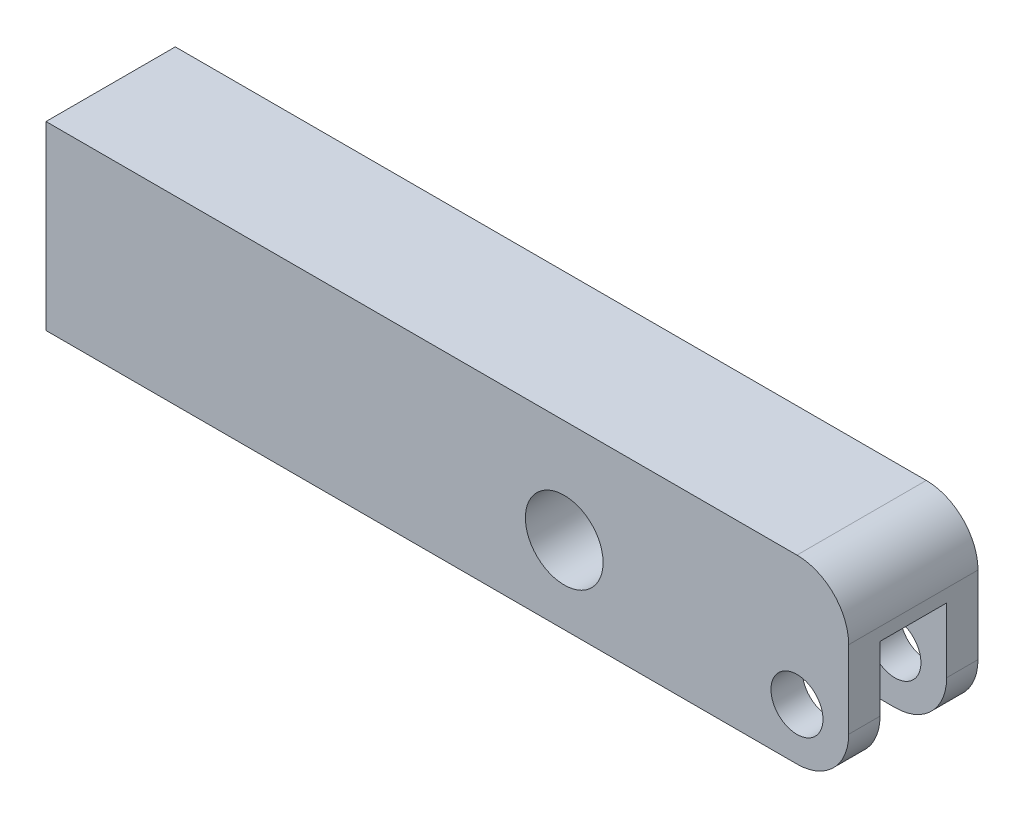
ISO-10303-21;
HEADER;
FILE_DESCRIPTION(('STEP AP214'),'2;1');
FILE_NAME('part.step','',(''),(''),'','','');
FILE_SCHEMA(('AUTOMOTIVE_DESIGN { 1 0 10303 214 1 1 1 1 }'));
ENDSEC;
DATA;
#1=APPLICATION_CONTEXT('core data for automotive mechanical design processes');
#2=APPLICATION_PROTOCOL_DEFINITION('international standard','automotive_design',2000,#1);
#3=PRODUCT_CONTEXT('',#1,'mechanical');
#4=PRODUCT('Part','Part','',(#3));
#5=PRODUCT_RELATED_PRODUCT_CATEGORY('part','',(#4));
#6=PRODUCT_DEFINITION_FORMATION('','',#4);
#7=PRODUCT_DEFINITION_CONTEXT('part definition',#1,'design');
#8=PRODUCT_DEFINITION('design','',#6,#7);
#9=PRODUCT_DEFINITION_SHAPE('','',#8);
#10=(LENGTH_UNIT() NAMED_UNIT(*) SI_UNIT(.MILLI.,.METRE.));
#11=(NAMED_UNIT(*) PLANE_ANGLE_UNIT() SI_UNIT($,.RADIAN.));
#12=(NAMED_UNIT(*) SI_UNIT($,.STERADIAN.) SOLID_ANGLE_UNIT());
#13=UNCERTAINTY_MEASURE_WITH_UNIT(LENGTH_MEASURE(1.E-05),#10,'distance_accuracy_value','');
#14=(GEOMETRIC_REPRESENTATION_CONTEXT(3) GLOBAL_UNCERTAINTY_ASSIGNED_CONTEXT((#13)) GLOBAL_UNIT_ASSIGNED_CONTEXT((#10,
#11,#12)) REPRESENTATION_CONTEXT('',''));
#15=CARTESIAN_POINT('',(0.,0.,0.));
#16=DIRECTION('',(0.,0.,1.));
#17=DIRECTION('',(1.,0.,0.));
#18=AXIS2_PLACEMENT_3D('',#15,#16,#17);
#19=CARTESIAN_POINT('',(0.,0.,7.9375));
#20=DIRECTION('',(0.,0.,-1.));
#21=DIRECTION('',(-1.,0.,0.));
#22=AXIS2_PLACEMENT_3D('',#19,#20,#21);
#23=CYLINDRICAL_SURFACE('',#22,3.19405);
#24=CARTESIAN_POINT('',(0.,0.,4.0894));
#25=DIRECTION('',(0.,0.,1.));
#26=DIRECTION('',(1.,0.,0.));
#27=AXIS2_PLACEMENT_3D('',#24,#25,#26);
#28=CIRCLE('',#27,3.19405);
#29=CARTESIAN_POINT('',(3.19405,0.,4.0894));
#30=VERTEX_POINT('',#29);
#31=EDGE_CURVE('E163',#30,#30,#28,.T.);
#32=ORIENTED_EDGE('',*,*,#31,.F.);
#33=EDGE_LOOP('',(#32));
#34=FACE_BOUND('',#33,.T.);
#35=CARTESIAN_POINT('',(0.,0.,7.9375));
#36=DIRECTION('',(0.,0.,1.));
#37=DIRECTION('',(1.,0.,0.));
#38=AXIS2_PLACEMENT_3D('',#35,#36,#37);
#39=CIRCLE('',#38,3.19405);
#40=CARTESIAN_POINT('',(3.19405,0.,7.9375));
#41=VERTEX_POINT('',#40);
#42=EDGE_CURVE('E164',#41,#41,#39,.T.);
#43=ORIENTED_EDGE('',*,*,#42,.T.);
#44=EDGE_LOOP('',(#43));
#45=FACE_BOUND('',#44,.T.);
#46=ADVANCED_FACE('F35',(#34,#45),#23,.F.);
#47=CARTESIAN_POINT('',(-92.202,-6.35,7.9375));
#48=DIRECTION('',(0.,0.,1.));
#49=DIRECTION('',(1.,0.,0.));
#50=AXIS2_PLACEMENT_3D('',#47,#48,#49);
#51=PLANE('',#50);
#52=ORIENTED_EDGE('',*,*,#42,.F.);
#53=EDGE_LOOP('',(#52));
#54=FACE_BOUND('',#53,.T.);
#55=DIRECTION('',(0.,1.,0.));
#56=VECTOR('',#55,1.);
#57=CARTESIAN_POINT('',(6.35,15.875,7.9375));
#58=LINE('',#57,#56);
#59=CARTESIAN_POINT('',(6.35,0.,7.9375));
#60=VERTEX_POINT('',#59);
#61=CARTESIAN_POINT('',(6.35,9.525,7.9375));
#62=VERTEX_POINT('',#61);
#63=EDGE_CURVE('E177',#60,#62,#58,.T.);
#64=ORIENTED_EDGE('',*,*,#63,.T.);
#65=CARTESIAN_POINT('',(0.,9.525,7.9375));
#66=DIRECTION('',(0.,0.,1.));
#67=DIRECTION('',(1.,0.,0.));
#68=AXIS2_PLACEMENT_3D('',#65,#66,#67);
#69=CIRCLE('',#68,6.35);
#70=CARTESIAN_POINT('',(0.,15.875,7.9375));
#71=VERTEX_POINT('',#70);
#72=EDGE_CURVE('E217',#62,#71,#69,.T.);
#73=ORIENTED_EDGE('',*,*,#72,.T.);
#74=DIRECTION('',(-1.,0.,0.));
#75=VECTOR('',#74,1.);
#76=CARTESIAN_POINT('',(-92.202,15.875,7.9375));
#77=LINE('',#76,#75);
#78=CARTESIAN_POINT('',(-92.202,15.875,7.9375));
#79=VERTEX_POINT('',#78);
#80=EDGE_CURVE('E180',#71,#79,#77,.T.);
#81=ORIENTED_EDGE('',*,*,#80,.T.);
#82=DIRECTION('',(0.,-1.,0.));
#83=VECTOR('',#82,1.);
#84=CARTESIAN_POINT('',(-92.202,15.875,7.9375));
#85=LINE('',#84,#83);
#86=CARTESIAN_POINT('',(-92.202,-6.35,7.9375));
#87=VERTEX_POINT('',#86);
#88=EDGE_CURVE('E170',#79,#87,#85,.T.);
#89=ORIENTED_EDGE('',*,*,#88,.T.);
#90=DIRECTION('',(1.,0.,0.));
#91=VECTOR('',#90,1.);
#92=CARTESIAN_POINT('',(-92.202,-6.35,7.9375));
#93=LINE('',#92,#91);
#94=CARTESIAN_POINT('',(0.,-6.35,7.9375));
#95=VERTEX_POINT('',#94);
#96=EDGE_CURVE('E173',#87,#95,#93,.T.);
#97=ORIENTED_EDGE('',*,*,#96,.T.);
#98=CARTESIAN_POINT('',(0.,0.,7.9375));
#99=DIRECTION('',(0.,0.,1.));
#100=DIRECTION('',(1.,0.,0.));
#101=AXIS2_PLACEMENT_3D('',#98,#99,#100);
#102=CIRCLE('',#101,6.35);
#103=EDGE_CURVE('E215',#95,#60,#102,.T.);
#104=ORIENTED_EDGE('',*,*,#103,.T.);
#105=EDGE_LOOP('',(#64,#73,#81,#89,#97,#104));
#106=FACE_BOUND('',#105,.T.);
#107=CARTESIAN_POINT('',(-28.575,3.175,7.9375));
#108=DIRECTION('',(0.,0.,1.));
#109=DIRECTION('',(1.,0.,0.));
#110=AXIS2_PLACEMENT_3D('',#107,#108,#109);
#111=CIRCLE('',#110,4.76885);
#112=CARTESIAN_POINT('',(-23.80615,3.175,7.9375));
#113=VERTEX_POINT('',#112);
#114=EDGE_CURVE('E156',#113,#113,#111,.T.);
#115=ORIENTED_EDGE('',*,*,#114,.F.);
#116=EDGE_LOOP('',(#115));
#117=FACE_BOUND('',#116,.T.);
#118=ADVANCED_FACE('F251',(#54,#106,#117),#51,.T.);
#119=CARTESIAN_POINT('',(-92.202,-6.35,-7.9375));
#120=DIRECTION('',(0.,0.,1.));
#121=DIRECTION('',(1.,0.,0.));
#122=AXIS2_PLACEMENT_3D('',#119,#120,#121);
#123=PLANE('',#122);
#124=CARTESIAN_POINT('',(0.,0.,-7.9375));
#125=DIRECTION('',(0.,0.,1.));
#126=DIRECTION('',(1.,0.,0.));
#127=AXIS2_PLACEMENT_3D('',#124,#125,#126);
#128=CIRCLE('',#127,3.19405);
#129=CARTESIAN_POINT('',(3.19405,0.,-7.9375));
#130=VERTEX_POINT('',#129);
#131=EDGE_CURVE('E159',#130,#130,#128,.T.);
#132=ORIENTED_EDGE('',*,*,#131,.T.);
#133=EDGE_LOOP('',(#132));
#134=FACE_BOUND('',#133,.T.);
#135=DIRECTION('',(-1.,0.,0.));
#136=VECTOR('',#135,1.);
#137=CARTESIAN_POINT('',(-92.202,15.875,-7.9375));
#138=LINE('',#137,#136);
#139=CARTESIAN_POINT('',(0.,15.875,-7.9375));
#140=VERTEX_POINT('',#139);
#141=CARTESIAN_POINT('',(-92.202,15.875,-7.9375));
#142=VERTEX_POINT('',#141);
#143=EDGE_CURVE('E174',#140,#142,#138,.T.);
#144=ORIENTED_EDGE('',*,*,#143,.F.);
#145=CARTESIAN_POINT('',(0.,9.525,-7.9375));
#146=DIRECTION('',(0.,0.,1.));
#147=DIRECTION('',(1.,0.,0.));
#148=AXIS2_PLACEMENT_3D('',#145,#146,#147);
#149=CIRCLE('',#148,6.35);
#150=CARTESIAN_POINT('',(6.35,9.525,-7.9375));
#151=VERTEX_POINT('',#150);
#152=EDGE_CURVE('E205',#140,#151,#149,.F.);
#153=ORIENTED_EDGE('',*,*,#152,.T.);
#154=DIRECTION('',(0.,1.,0.));
#155=VECTOR('',#154,1.);
#156=CARTESIAN_POINT('',(6.35,15.875,-7.9375));
#157=LINE('',#156,#155);
#158=CARTESIAN_POINT('',(6.35,0.,-7.9375));
#159=VERTEX_POINT('',#158);
#160=EDGE_CURVE('E187',#159,#151,#157,.T.);
#161=ORIENTED_EDGE('',*,*,#160,.F.);
#162=CARTESIAN_POINT('',(0.,0.,-7.9375));
#163=DIRECTION('',(0.,0.,1.));
#164=DIRECTION('',(1.,0.,0.));
#165=AXIS2_PLACEMENT_3D('',#162,#163,#164);
#166=CIRCLE('',#165,6.35);
#167=CARTESIAN_POINT('',(0.,-6.35,-7.9375));
#168=VERTEX_POINT('',#167);
#169=EDGE_CURVE('E203',#159,#168,#166,.F.);
#170=ORIENTED_EDGE('',*,*,#169,.T.);
#171=DIRECTION('',(1.,0.,0.));
#172=VECTOR('',#171,1.);
#173=CARTESIAN_POINT('',(-92.202,-6.35,-7.9375));
#174=LINE('',#173,#172);
#175=CARTESIAN_POINT('',(-92.202,-6.35,-7.9375));
#176=VERTEX_POINT('',#175);
#177=EDGE_CURVE('E185',#176,#168,#174,.T.);
#178=ORIENTED_EDGE('',*,*,#177,.F.);
#179=DIRECTION('',(0.,-1.,0.));
#180=VECTOR('',#179,1.);
#181=CARTESIAN_POINT('',(-92.202,15.875,-7.9375));
#182=LINE('',#181,#180);
#183=EDGE_CURVE('E167',#142,#176,#182,.T.);
#184=ORIENTED_EDGE('',*,*,#183,.F.);
#185=EDGE_LOOP('',(#144,#153,#161,#170,#178,#184));
#186=FACE_BOUND('',#185,.T.);
#187=CARTESIAN_POINT('',(-28.575,3.175,-7.9375));
#188=DIRECTION('',(0.,0.,1.));
#189=DIRECTION('',(1.,0.,0.));
#190=AXIS2_PLACEMENT_3D('',#187,#188,#189);
#191=CIRCLE('',#190,4.76885);
#192=CARTESIAN_POINT('',(-23.80615,3.175,-7.9375));
#193=VERTEX_POINT('',#192);
#194=EDGE_CURVE('E160',#193,#193,#191,.T.);
#195=ORIENTED_EDGE('',*,*,#194,.T.);
#196=EDGE_LOOP('',(#195));
#197=FACE_BOUND('',#196,.T.);
#198=ADVANCED_FACE('F231',(#134,#186,#197),#123,.F.);
#199=CARTESIAN_POINT('',(-92.202,15.875,7.9375));
#200=DIRECTION('',(1.,0.,0.));
#201=DIRECTION('',(0.,0.,-1.));
#202=AXIS2_PLACEMENT_3D('',#199,#200,#201);
#203=PLANE('',#202);
#204=ORIENTED_EDGE('',*,*,#183,.T.);
#205=DIRECTION('',(0.,0.,-1.));
#206=VECTOR('',#205,1.);
#207=CARTESIAN_POINT('',(-92.202,-6.35,7.9375));
#208=LINE('',#207,#206);
#209=EDGE_CURVE('E193',#87,#176,#208,.T.);
#210=ORIENTED_EDGE('',*,*,#209,.F.);
#211=ORIENTED_EDGE('',*,*,#88,.F.);
#212=DIRECTION('',(0.,0.,-1.));
#213=VECTOR('',#212,1.);
#214=CARTESIAN_POINT('',(-92.202,15.875,7.9375));
#215=LINE('',#214,#213);
#216=EDGE_CURVE('E182',#79,#142,#215,.T.);
#217=ORIENTED_EDGE('',*,*,#216,.T.);
#218=EDGE_LOOP('',(#204,#210,#211,#217));
#219=FACE_BOUND('',#218,.T.);
#220=ADVANCED_FACE('F238',(#219),#203,.F.);
#221=CARTESIAN_POINT('',(-92.202,-6.35,7.9375));
#222=DIRECTION('',(0.,1.,0.));
#223=DIRECTION('',(0.,0.,1.));
#224=AXIS2_PLACEMENT_3D('',#221,#222,#223);
#225=PLANE('',#224);
#226=ORIENTED_EDGE('',*,*,#177,.T.);
#227=DIRECTION('',(0.,0.,-1.));
#228=VECTOR('',#227,1.);
#229=CARTESIAN_POINT('',(0.,-6.35,7.9375));
#230=LINE('',#229,#228);
#231=CARTESIAN_POINT('',(0.,-6.35,-4.0894));
#232=VERTEX_POINT('',#231);
#233=EDGE_CURVE('E50',#168,#232,#230,.F.);
#234=ORIENTED_EDGE('',*,*,#233,.T.);
#235=DIRECTION('',(1.,0.,0.));
#236=VECTOR('',#235,1.);
#237=CARTESIAN_POINT('',(-7.9248,-6.35,-4.0894));
#238=LINE('',#237,#236);
#239=CARTESIAN_POINT('',(-7.9248,-6.35,-4.0894));
#240=VERTEX_POINT('',#239);
#241=EDGE_CURVE('E143',#240,#232,#238,.T.);
#242=ORIENTED_EDGE('',*,*,#241,.F.);
#243=CARTESIAN_POINT('',(-7.9248,-6.35,0.));
#244=DIRECTION('',(0.,-1.,0.));
#245=DIRECTION('',(0.,0.,-1.));
#246=AXIS2_PLACEMENT_3D('',#243,#244,#245);
#247=CIRCLE('',#246,4.0894);
#248=CARTESIAN_POINT('',(-7.9248,-6.35,4.0894));
#249=VERTEX_POINT('',#248);
#250=EDGE_CURVE('E126',#249,#240,#247,.T.);
#251=ORIENTED_EDGE('',*,*,#250,.F.);
#252=DIRECTION('',(-1.,0.,0.));
#253=VECTOR('',#252,1.);
#254=CARTESIAN_POINT('',(-7.9248,-6.35,4.0894));
#255=LINE('',#254,#253);
#256=CARTESIAN_POINT('',(0.,-6.35,4.0894));
#257=VERTEX_POINT('',#256);
#258=EDGE_CURVE('E141',#257,#249,#255,.T.);
#259=ORIENTED_EDGE('',*,*,#258,.F.);
#260=DIRECTION('',(0.,0.,-1.));
#261=VECTOR('',#260,1.);
#262=CARTESIAN_POINT('',(0.,-6.35,7.9375));
#263=LINE('',#262,#261);
#264=EDGE_CURVE('E219',#257,#95,#263,.F.);
#265=ORIENTED_EDGE('',*,*,#264,.T.);
#266=ORIENTED_EDGE('',*,*,#96,.F.);
#267=ORIENTED_EDGE('',*,*,#209,.T.);
#268=EDGE_LOOP('',(#226,#234,#242,#251,#259,#265,#266,#267));
#269=FACE_BOUND('',#268,.T.);
#270=ADVANCED_FACE('F234',(#269),#225,.F.);
#271=CARTESIAN_POINT('',(6.35,15.875,7.9375));
#272=DIRECTION('',(-1.,0.,0.));
#273=DIRECTION('',(0.,-1.,0.));
#274=AXIS2_PLACEMENT_3D('',#271,#272,#273);
#275=PLANE('',#274);
#276=ORIENTED_EDGE('',*,*,#160,.T.);
#277=DIRECTION('',(0.,0.,-1.));
#278=VECTOR('',#277,1.);
#279=CARTESIAN_POINT('',(6.35,9.525,7.9375));
#280=LINE('',#279,#278);
#281=EDGE_CURVE('E213',#151,#62,#280,.F.);
#282=ORIENTED_EDGE('',*,*,#281,.T.);
#283=ORIENTED_EDGE('',*,*,#63,.F.);
#284=DIRECTION('',(0.,0.,-1.));
#285=VECTOR('',#284,1.);
#286=CARTESIAN_POINT('',(6.35,0.,7.9375));
#287=LINE('',#286,#285);
#288=CARTESIAN_POINT('',(6.34999999999999,0.,4.0894));
#289=VERTEX_POINT('',#288);
#290=EDGE_CURVE('E207',#60,#289,#287,.T.);
#291=ORIENTED_EDGE('',*,*,#290,.T.);
#292=DIRECTION('',(0.,-1.,0.));
#293=VECTOR('',#292,1.);
#294=CARTESIAN_POINT('',(6.34999999999999,7.9502,4.0894));
#295=LINE('',#294,#293);
#296=CARTESIAN_POINT('',(6.34999999999999,7.9502,4.0894));
#297=VERTEX_POINT('',#296);
#298=EDGE_CURVE('E153',#297,#289,#295,.T.);
#299=ORIENTED_EDGE('',*,*,#298,.F.);
#300=DIRECTION('',(0.,0.,1.));
#301=VECTOR('',#300,1.);
#302=CARTESIAN_POINT('',(6.34999999999999,7.9502,4.0894));
#303=LINE('',#302,#301);
#304=CARTESIAN_POINT('',(6.35,7.9502,-4.0894));
#305=VERTEX_POINT('',#304);
#306=EDGE_CURVE('E137',#305,#297,#303,.T.);
#307=ORIENTED_EDGE('',*,*,#306,.F.);
#308=DIRECTION('',(0.,-1.,0.));
#309=VECTOR('',#308,1.);
#310=CARTESIAN_POINT('',(6.35,7.9502,-4.0894));
#311=LINE('',#310,#309);
#312=CARTESIAN_POINT('',(6.35,0.,-4.0894));
#313=VERTEX_POINT('',#312);
#314=EDGE_CURVE('E128',#305,#313,#311,.T.);
#315=ORIENTED_EDGE('',*,*,#314,.T.);
#316=DIRECTION('',(0.,0.,-1.));
#317=VECTOR('',#316,1.);
#318=CARTESIAN_POINT('',(6.35,0.,7.9375));
#319=LINE('',#318,#317);
#320=EDGE_CURVE('E210',#313,#159,#319,.T.);
#321=ORIENTED_EDGE('',*,*,#320,.T.);
#322=EDGE_LOOP('',(#276,#282,#283,#291,#299,#307,#315,#321));
#323=FACE_BOUND('',#322,.T.);
#324=ADVANCED_FACE('F225',(#323),#275,.F.);
#325=CARTESIAN_POINT('',(-92.202,15.875,7.9375));
#326=DIRECTION('',(0.,-1.,0.));
#327=DIRECTION('',(0.,0.,-1.));
#328=AXIS2_PLACEMENT_3D('',#325,#326,#327);
#329=PLANE('',#328);
#330=ORIENTED_EDGE('',*,*,#80,.F.);
#331=DIRECTION('',(0.,0.,-1.));
#332=VECTOR('',#331,1.);
#333=CARTESIAN_POINT('',(0.,15.875,7.9375));
#334=LINE('',#333,#332);
#335=EDGE_CURVE('E196',#71,#140,#334,.T.);
#336=ORIENTED_EDGE('',*,*,#335,.T.);
#337=ORIENTED_EDGE('',*,*,#143,.T.);
#338=ORIENTED_EDGE('',*,*,#216,.F.);
#339=EDGE_LOOP('',(#330,#336,#337,#338));
#340=FACE_BOUND('',#339,.T.);
#341=ADVANCED_FACE('F242',(#340),#329,.F.);
#342=CARTESIAN_POINT('',(0.,0.,-4.0894));
#343=DIRECTION('',(0.,0.,-1.));
#344=DIRECTION('',(-1.,0.,0.));
#345=AXIS2_PLACEMENT_3D('',#342,#343,#344);
#346=CIRCLE('',#345,3.19405);
#347=CARTESIAN_POINT('',(-3.19405,0.,-4.0894));
#348=VERTEX_POINT('',#347);
#349=EDGE_CURVE('E152',#348,#348,#346,.T.);
#350=ORIENTED_EDGE('',*,*,#349,.F.);
#351=EDGE_LOOP('',(#350));
#352=FACE_BOUND('',#351,.T.);
#353=ORIENTED_EDGE('',*,*,#131,.F.);
#354=EDGE_LOOP('',(#353));
#355=FACE_BOUND('',#354,.T.);
#356=ADVANCED_FACE('F272',(#352,#355),#23,.F.);
#357=CARTESIAN_POINT('',(-28.575,3.175,7.9375));
#358=DIRECTION('',(0.,0.,-1.));
#359=DIRECTION('',(-1.,0.,0.));
#360=AXIS2_PLACEMENT_3D('',#357,#358,#359);
#361=CYLINDRICAL_SURFACE('',#360,4.76885);
#362=ORIENTED_EDGE('',*,*,#114,.T.);
#363=EDGE_LOOP('',(#362));
#364=FACE_BOUND('',#363,.T.);
#365=ORIENTED_EDGE('',*,*,#194,.F.);
#366=EDGE_LOOP('',(#365));
#367=FACE_BOUND('',#366,.T.);
#368=ADVANCED_FACE('F266',(#364,#367),#361,.F.);
#369=CARTESIAN_POINT('',(-7.9248,7.9502,0.));
#370=DIRECTION('',(0.,-1.,0.));
#371=DIRECTION('',(0.,0.,-1.));
#372=AXIS2_PLACEMENT_3D('',#369,#370,#371);
#373=CYLINDRICAL_SURFACE('',#372,4.0894);
#374=ORIENTED_EDGE('',*,*,#250,.T.);
#375=DIRECTION('',(0.,-1.,0.));
#376=VECTOR('',#375,1.);
#377=CARTESIAN_POINT('',(-7.9248,7.9502,-4.0894));
#378=LINE('',#377,#376);
#379=CARTESIAN_POINT('',(-7.9248,7.9502,-4.0894));
#380=VERTEX_POINT('',#379);
#381=EDGE_CURVE('E118',#380,#240,#378,.T.);
#382=ORIENTED_EDGE('',*,*,#381,.F.);
#383=CARTESIAN_POINT('',(-7.9248,7.9502,0.));
#384=DIRECTION('',(0.,-1.,0.));
#385=DIRECTION('',(0.,0.,-1.));
#386=AXIS2_PLACEMENT_3D('',#383,#384,#385);
#387=CIRCLE('',#386,4.0894);
#388=CARTESIAN_POINT('',(-7.9248,7.9502,4.0894));
#389=VERTEX_POINT('',#388);
#390=EDGE_CURVE('E123',#389,#380,#387,.T.);
#391=ORIENTED_EDGE('',*,*,#390,.F.);
#392=DIRECTION('',(0.,-1.,0.));
#393=VECTOR('',#392,1.);
#394=CARTESIAN_POINT('',(-7.9248,7.9502,4.0894));
#395=LINE('',#394,#393);
#396=EDGE_CURVE('E150',#389,#249,#395,.T.);
#397=ORIENTED_EDGE('',*,*,#396,.T.);
#398=EDGE_LOOP('',(#374,#382,#391,#397));
#399=FACE_BOUND('',#398,.T.);
#400=ADVANCED_FACE('F120',(#399),#373,.F.);
#401=CARTESIAN_POINT('',(-7.9248,7.9502,4.0894));
#402=DIRECTION('',(0.,0.,1.));
#403=DIRECTION('',(1.,0.,0.));
#404=AXIS2_PLACEMENT_3D('',#401,#402,#403);
#405=PLANE('',#404);
#406=ORIENTED_EDGE('',*,*,#31,.T.);
#407=EDGE_LOOP('',(#406));
#408=FACE_BOUND('',#407,.T.);
#409=ORIENTED_EDGE('',*,*,#298,.T.);
#410=CARTESIAN_POINT('',(0.,0.,4.0894));
#411=DIRECTION('',(0.,0.,1.));
#412=DIRECTION('',(1.,0.,0.));
#413=AXIS2_PLACEMENT_3D('',#410,#411,#412);
#414=CIRCLE('',#413,6.35);
#415=EDGE_CURVE('E11',#289,#257,#414,.F.);
#416=ORIENTED_EDGE('',*,*,#415,.T.);
#417=ORIENTED_EDGE('',*,*,#258,.T.);
#418=ORIENTED_EDGE('',*,*,#396,.F.);
#419=DIRECTION('',(-1.,0.,0.));
#420=VECTOR('',#419,1.);
#421=CARTESIAN_POINT('',(-7.9248,7.9502,4.0894));
#422=LINE('',#421,#420);
#423=EDGE_CURVE('E129',#297,#389,#422,.T.);
#424=ORIENTED_EDGE('',*,*,#423,.F.);
#425=EDGE_LOOP('',(#409,#416,#417,#418,#424));
#426=FACE_BOUND('',#425,.T.);
#427=ADVANCED_FACE('F256',(#408,#426),#405,.F.);
#428=CARTESIAN_POINT('',(-7.9248,7.9502,-4.0894));
#429=DIRECTION('',(0.,0.,-1.));
#430=DIRECTION('',(-1.,0.,0.));
#431=AXIS2_PLACEMENT_3D('',#428,#429,#430);
#432=PLANE('',#431);
#433=ORIENTED_EDGE('',*,*,#349,.T.);
#434=EDGE_LOOP('',(#433));
#435=FACE_BOUND('',#434,.T.);
#436=ORIENTED_EDGE('',*,*,#241,.T.);
#437=CARTESIAN_POINT('',(0.,0.,-4.0894));
#438=DIRECTION('',(0.,0.,-1.));
#439=DIRECTION('',(-1.,0.,0.));
#440=AXIS2_PLACEMENT_3D('',#437,#438,#439);
#441=CIRCLE('',#440,6.35);
#442=EDGE_CURVE('E43',#232,#313,#441,.F.);
#443=ORIENTED_EDGE('',*,*,#442,.T.);
#444=ORIENTED_EDGE('',*,*,#314,.F.);
#445=DIRECTION('',(1.,0.,0.));
#446=VECTOR('',#445,1.);
#447=CARTESIAN_POINT('',(-7.9248,7.9502,-4.0894));
#448=LINE('',#447,#446);
#449=EDGE_CURVE('E132',#380,#305,#448,.T.);
#450=ORIENTED_EDGE('',*,*,#449,.F.);
#451=ORIENTED_EDGE('',*,*,#381,.T.);
#452=EDGE_LOOP('',(#436,#443,#444,#450,#451));
#453=FACE_BOUND('',#452,.T.);
#454=ADVANCED_FACE('F133',(#435,#453),#432,.F.);
#455=CARTESIAN_POINT('',(-7.9248,7.9502,0.));
#456=DIRECTION('',(0.,-1.,0.));
#457=DIRECTION('',(0.,0.,-1.));
#458=AXIS2_PLACEMENT_3D('',#455,#456,#457);
#459=PLANE('',#458);
#460=ORIENTED_EDGE('',*,*,#390,.T.);
#461=ORIENTED_EDGE('',*,*,#449,.T.);
#462=ORIENTED_EDGE('',*,*,#306,.T.);
#463=ORIENTED_EDGE('',*,*,#423,.T.);
#464=EDGE_LOOP('',(#460,#461,#462,#463));
#465=FACE_BOUND('',#464,.T.);
#466=ADVANCED_FACE('F139',(#465),#459,.T.);
#467=CARTESIAN_POINT('',(0.,9.525,7.9375));
#468=DIRECTION('',(0.,0.,-1.));
#469=DIRECTION('',(-1.,0.,0.));
#470=AXIS2_PLACEMENT_3D('',#467,#468,#469);
#471=CYLINDRICAL_SURFACE('',#470,6.35);
#472=ORIENTED_EDGE('',*,*,#72,.F.);
#473=ORIENTED_EDGE('',*,*,#281,.F.);
#474=ORIENTED_EDGE('',*,*,#152,.F.);
#475=ORIENTED_EDGE('',*,*,#335,.F.);
#476=EDGE_LOOP('',(#472,#473,#474,#475));
#477=FACE_BOUND('',#476,.T.);
#478=ADVANCED_FACE('F246',(#477),#471,.T.);
#479=CARTESIAN_POINT('',(0.,0.,7.9375));
#480=DIRECTION('',(0.,0.,-1.));
#481=DIRECTION('',(-1.,0.,0.));
#482=AXIS2_PLACEMENT_3D('',#479,#480,#481);
#483=CYLINDRICAL_SURFACE('',#482,6.35);
#484=ORIENTED_EDGE('',*,*,#442,.F.);
#485=ORIENTED_EDGE('',*,*,#233,.F.);
#486=ORIENTED_EDGE('',*,*,#169,.F.);
#487=ORIENTED_EDGE('',*,*,#320,.F.);
#488=EDGE_LOOP('',(#484,#485,#486,#487));
#489=FACE_BOUND('',#488,.T.);
#490=ADVANCED_FACE('F228',(#489),#483,.T.);
#491=CARTESIAN_POINT('',(0.,0.,7.9375));
#492=DIRECTION('',(0.,0.,-1.));
#493=DIRECTION('',(-1.,0.,0.));
#494=AXIS2_PLACEMENT_3D('',#491,#492,#493);
#495=CYLINDRICAL_SURFACE('',#494,6.35);
#496=ORIENTED_EDGE('',*,*,#103,.F.);
#497=ORIENTED_EDGE('',*,*,#264,.F.);
#498=ORIENTED_EDGE('',*,*,#415,.F.);
#499=ORIENTED_EDGE('',*,*,#290,.F.);
#500=EDGE_LOOP('',(#496,#497,#498,#499));
#501=FACE_BOUND('',#500,.T.);
#502=ADVANCED_FACE('F37',(#501),#495,.T.);
#503=CLOSED_SHELL('',(#46,#118,#198,#220,#270,#324,#341,#356,#368,#400,#427,#454,#466,#478,#490,#502));
#504=MANIFOLD_SOLID_BREP('B2',#503);
#505=ADVANCED_BREP_SHAPE_REPRESENTATION('',(#18,#504),#14);
#506=SHAPE_DEFINITION_REPRESENTATION(#9,#505);
ENDSEC;
END-ISO-10303-21;
